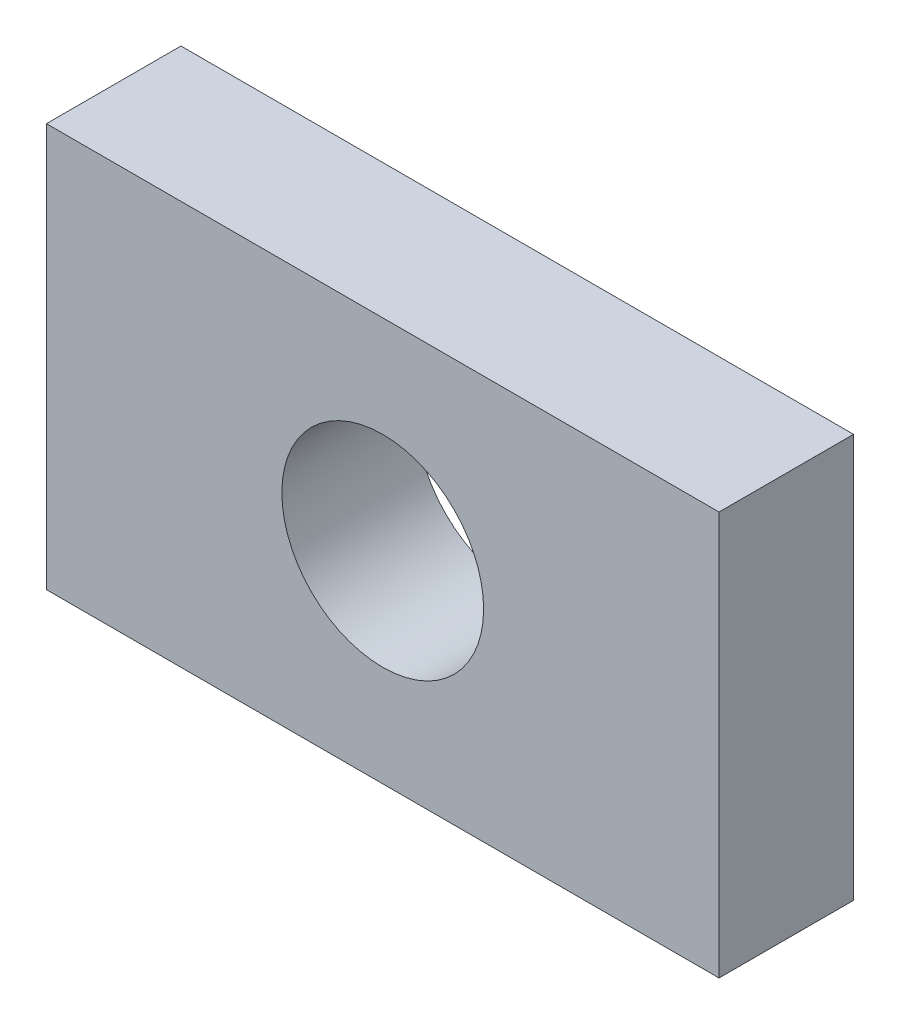
ISO-10303-21;
HEADER;
FILE_DESCRIPTION(('STEP AP214'),'2;1');
FILE_NAME('part.step','',(''),(''),'','','');
FILE_SCHEMA(('AUTOMOTIVE_DESIGN { 1 0 10303 214 1 1 1 1 }'));
ENDSEC;
DATA;
#1=APPLICATION_CONTEXT('core data for automotive mechanical design processes');
#2=APPLICATION_PROTOCOL_DEFINITION('international standard','automotive_design',2000,#1);
#3=PRODUCT_CONTEXT('',#1,'mechanical');
#4=PRODUCT('Part','Part','',(#3));
#5=PRODUCT_RELATED_PRODUCT_CATEGORY('part','',(#4));
#6=PRODUCT_DEFINITION_FORMATION('','',#4);
#7=PRODUCT_DEFINITION_CONTEXT('part definition',#1,'design');
#8=PRODUCT_DEFINITION('design','',#6,#7);
#9=PRODUCT_DEFINITION_SHAPE('','',#8);
#10=(LENGTH_UNIT() NAMED_UNIT(*) SI_UNIT(.MILLI.,.METRE.));
#11=(NAMED_UNIT(*) PLANE_ANGLE_UNIT() SI_UNIT($,.RADIAN.));
#12=(NAMED_UNIT(*) SI_UNIT($,.STERADIAN.) SOLID_ANGLE_UNIT());
#13=UNCERTAINTY_MEASURE_WITH_UNIT(LENGTH_MEASURE(1.E-05),#10,'distance_accuracy_value','');
#14=(GEOMETRIC_REPRESENTATION_CONTEXT(3) GLOBAL_UNCERTAINTY_ASSIGNED_CONTEXT((#13)) GLOBAL_UNIT_ASSIGNED_CONTEXT((#10,
#11,#12)) REPRESENTATION_CONTEXT('',''));
#15=CARTESIAN_POINT('',(0.,0.,0.));
#16=DIRECTION('',(0.,0.,1.));
#17=DIRECTION('',(1.,0.,0.));
#18=AXIS2_PLACEMENT_3D('',#15,#16,#17);
#19=CARTESIAN_POINT('',(0.,0.,2.));
#20=DIRECTION('',(0.,0.,-1.));
#21=DIRECTION('',(-1.,0.,0.));
#22=AXIS2_PLACEMENT_3D('',#19,#20,#21);
#23=PLANE('',#22);
#24=DIRECTION('',(-1.,0.,0.));
#25=VECTOR('',#24,1.);
#26=CARTESIAN_POINT('',(-4.99999999999989,3.00000000000034,2.));
#27=LINE('',#26,#25);
#28=CARTESIAN_POINT('',(4.99999999999989,3.00000000000034,2.));
#29=VERTEX_POINT('',#28);
#30=CARTESIAN_POINT('',(-4.99999999999989,3.00000000000034,2.));
#31=VERTEX_POINT('',#30);
#32=EDGE_CURVE('E86',#29,#31,#27,.T.);
#33=ORIENTED_EDGE('',*,*,#32,.T.);
#34=DIRECTION('',(0.,-1.,0.));
#35=VECTOR('',#34,1.);
#36=CARTESIAN_POINT('',(-4.99999999999989,3.00000000000034,2.));
#37=LINE('',#36,#35);
#38=CARTESIAN_POINT('',(-4.99999999999989,-2.99999999999967,2.));
#39=VERTEX_POINT('',#38);
#40=EDGE_CURVE('E81',#31,#39,#37,.T.);
#41=ORIENTED_EDGE('',*,*,#40,.T.);
#42=DIRECTION('',(1.,0.,0.));
#43=VECTOR('',#42,1.);
#44=CARTESIAN_POINT('',(4.99999999999989,-2.99999999999967,2.));
#45=LINE('',#44,#43);
#46=CARTESIAN_POINT('',(4.99999999999989,-2.99999999999967,2.));
#47=VERTEX_POINT('',#46);
#48=EDGE_CURVE('E84',#39,#47,#45,.T.);
#49=ORIENTED_EDGE('',*,*,#48,.T.);
#50=DIRECTION('',(0.,1.,0.));
#51=VECTOR('',#50,1.);
#52=CARTESIAN_POINT('',(4.99999999999989,3.00000000000034,2.));
#53=LINE('',#52,#51);
#54=EDGE_CURVE('E51',#47,#29,#53,.T.);
#55=ORIENTED_EDGE('',*,*,#54,.T.);
#56=EDGE_LOOP('',(#33,#41,#49,#55));
#57=FACE_BOUND('',#56,.T.);
#58=CARTESIAN_POINT('',(0.,0.,2.));
#59=DIRECTION('',(0.,0.,1.));
#60=DIRECTION('',(1.,0.,0.));
#61=AXIS2_PLACEMENT_3D('',#58,#59,#60);
#62=CIRCLE('',#61,1.50000000000006);
#63=CARTESIAN_POINT('',(1.50000000000006,0.,2.));
#64=VERTEX_POINT('',#63);
#65=EDGE_CURVE('E101',#64,#64,#62,.T.);
#66=ORIENTED_EDGE('',*,*,#65,.F.);
#67=EDGE_LOOP('',(#66));
#68=FACE_BOUND('',#67,.T.);
#69=ADVANCED_FACE('F34',(#57,#68),#23,.F.);
#70=CARTESIAN_POINT('',(0.,0.,0.));
#71=DIRECTION('',(0.,0.,-1.));
#72=DIRECTION('',(-1.,0.,0.));
#73=AXIS2_PLACEMENT_3D('',#70,#71,#72);
#74=PLANE('',#73);
#75=DIRECTION('',(-1.,0.,0.));
#76=VECTOR('',#75,1.);
#77=CARTESIAN_POINT('',(-4.99999999999989,3.00000000000034,0.));
#78=LINE('',#77,#76);
#79=CARTESIAN_POINT('',(4.99999999999989,3.00000000000034,0.));
#80=VERTEX_POINT('',#79);
#81=CARTESIAN_POINT('',(-4.99999999999989,3.00000000000034,0.));
#82=VERTEX_POINT('',#81);
#83=EDGE_CURVE('E98',#80,#82,#78,.T.);
#84=ORIENTED_EDGE('',*,*,#83,.F.);
#85=DIRECTION('',(0.,1.,0.));
#86=VECTOR('',#85,1.);
#87=CARTESIAN_POINT('',(4.99999999999989,3.00000000000034,0.));
#88=LINE('',#87,#86);
#89=CARTESIAN_POINT('',(4.99999999999989,-2.99999999999967,0.));
#90=VERTEX_POINT('',#89);
#91=EDGE_CURVE('E74',#90,#80,#88,.T.);
#92=ORIENTED_EDGE('',*,*,#91,.F.);
#93=DIRECTION('',(1.,0.,0.));
#94=VECTOR('',#93,1.);
#95=CARTESIAN_POINT('',(4.99999999999989,-2.99999999999967,0.));
#96=LINE('',#95,#94);
#97=CARTESIAN_POINT('',(-4.99999999999989,-2.99999999999967,0.));
#98=VERTEX_POINT('',#97);
#99=EDGE_CURVE('E68',#98,#90,#96,.T.);
#100=ORIENTED_EDGE('',*,*,#99,.F.);
#101=DIRECTION('',(0.,-1.,0.));
#102=VECTOR('',#101,1.);
#103=CARTESIAN_POINT('',(-4.99999999999989,3.00000000000034,0.));
#104=LINE('',#103,#102);
#105=EDGE_CURVE('E90',#82,#98,#104,.T.);
#106=ORIENTED_EDGE('',*,*,#105,.F.);
#107=EDGE_LOOP('',(#84,#92,#100,#106));
#108=FACE_BOUND('',#107,.T.);
#109=CARTESIAN_POINT('',(0.,0.,0.));
#110=DIRECTION('',(0.,0.,1.));
#111=DIRECTION('',(1.,0.,0.));
#112=AXIS2_PLACEMENT_3D('',#109,#110,#111);
#113=CIRCLE('',#112,1.50000000000006);
#114=CARTESIAN_POINT('',(1.50000000000006,0.,0.));
#115=VERTEX_POINT('',#114);
#116=EDGE_CURVE('E113',#115,#115,#113,.T.);
#117=ORIENTED_EDGE('',*,*,#116,.T.);
#118=EDGE_LOOP('',(#117));
#119=FACE_BOUND('',#118,.T.);
#120=ADVANCED_FACE('F109',(#108,#119),#74,.T.);
#121=CARTESIAN_POINT('',(-4.99999999999989,3.00000000000034,2.));
#122=DIRECTION('',(0.,-1.,0.));
#123=DIRECTION('',(0.,0.,-1.));
#124=AXIS2_PLACEMENT_3D('',#121,#122,#123);
#125=PLANE('',#124);
#126=ORIENTED_EDGE('',*,*,#83,.T.);
#127=DIRECTION('',(0.,0.,-1.));
#128=VECTOR('',#127,1.);
#129=CARTESIAN_POINT('',(-4.99999999999989,3.00000000000034,2.));
#130=LINE('',#129,#128);
#131=EDGE_CURVE('E11',#31,#82,#130,.T.);
#132=ORIENTED_EDGE('',*,*,#131,.F.);
#133=ORIENTED_EDGE('',*,*,#32,.F.);
#134=DIRECTION('',(0.,0.,-1.));
#135=VECTOR('',#134,1.);
#136=CARTESIAN_POINT('',(4.99999999999989,3.00000000000034,2.));
#137=LINE('',#136,#135);
#138=EDGE_CURVE('E94',#29,#80,#137,.T.);
#139=ORIENTED_EDGE('',*,*,#138,.T.);
#140=EDGE_LOOP('',(#126,#132,#133,#139));
#141=FACE_BOUND('',#140,.T.);
#142=ADVANCED_FACE('F36',(#141),#125,.F.);
#143=CARTESIAN_POINT('',(-4.99999999999989,3.00000000000034,2.));
#144=DIRECTION('',(1.,0.,0.));
#145=DIRECTION('',(0.,0.,-1.));
#146=AXIS2_PLACEMENT_3D('',#143,#144,#145);
#147=PLANE('',#146);
#148=ORIENTED_EDGE('',*,*,#105,.T.);
#149=DIRECTION('',(0.,0.,-1.));
#150=VECTOR('',#149,1.);
#151=CARTESIAN_POINT('',(-4.99999999999989,-2.99999999999967,2.));
#152=LINE('',#151,#150);
#153=EDGE_CURVE('E43',#39,#98,#152,.T.);
#154=ORIENTED_EDGE('',*,*,#153,.F.);
#155=ORIENTED_EDGE('',*,*,#40,.F.);
#156=ORIENTED_EDGE('',*,*,#131,.T.);
#157=EDGE_LOOP('',(#148,#154,#155,#156));
#158=FACE_BOUND('',#157,.T.);
#159=ADVANCED_FACE('F89',(#158),#147,.F.);
#160=CARTESIAN_POINT('',(4.99999999999989,-2.99999999999967,2.));
#161=DIRECTION('',(0.,1.,0.));
#162=DIRECTION('',(0.,0.,1.));
#163=AXIS2_PLACEMENT_3D('',#160,#161,#162);
#164=PLANE('',#163);
#165=ORIENTED_EDGE('',*,*,#99,.T.);
#166=DIRECTION('',(0.,0.,-1.));
#167=VECTOR('',#166,1.);
#168=CARTESIAN_POINT('',(4.99999999999989,-2.99999999999967,2.));
#169=LINE('',#168,#167);
#170=EDGE_CURVE('E91',#47,#90,#169,.T.);
#171=ORIENTED_EDGE('',*,*,#170,.F.);
#172=ORIENTED_EDGE('',*,*,#48,.F.);
#173=ORIENTED_EDGE('',*,*,#153,.T.);
#174=EDGE_LOOP('',(#165,#171,#172,#173));
#175=FACE_BOUND('',#174,.T.);
#176=ADVANCED_FACE('F92',(#175),#164,.F.);
#177=CARTESIAN_POINT('',(4.99999999999989,3.00000000000034,2.));
#178=DIRECTION('',(-1.,0.,0.));
#179=DIRECTION('',(0.,0.,1.));
#180=AXIS2_PLACEMENT_3D('',#177,#178,#179);
#181=PLANE('',#180);
#182=ORIENTED_EDGE('',*,*,#91,.T.);
#183=ORIENTED_EDGE('',*,*,#138,.F.);
#184=ORIENTED_EDGE('',*,*,#54,.F.);
#185=ORIENTED_EDGE('',*,*,#170,.T.);
#186=EDGE_LOOP('',(#182,#183,#184,#185));
#187=FACE_BOUND('',#186,.T.);
#188=ADVANCED_FACE('F106',(#187),#181,.F.);
#189=CARTESIAN_POINT('',(0.,0.,2.));
#190=DIRECTION('',(0.,0.,-1.));
#191=DIRECTION('',(-1.,0.,0.));
#192=AXIS2_PLACEMENT_3D('',#189,#190,#191);
#193=CYLINDRICAL_SURFACE('',#192,1.50000000000006);
#194=ORIENTED_EDGE('',*,*,#65,.T.);
#195=EDGE_LOOP('',(#194));
#196=FACE_BOUND('',#195,.T.);
#197=ORIENTED_EDGE('',*,*,#116,.F.);
#198=EDGE_LOOP('',(#197));
#199=FACE_BOUND('',#198,.T.);
#200=ADVANCED_FACE('F119',(#196,#199),#193,.F.);
#201=CLOSED_SHELL('',(#69,#120,#142,#159,#176,#188,#200));
#202=MANIFOLD_SOLID_BREP('B2',#201);
#203=ADVANCED_BREP_SHAPE_REPRESENTATION('',(#18,#202),#14);
#204=SHAPE_DEFINITION_REPRESENTATION(#9,#203);
ENDSEC;
END-ISO-10303-21;
